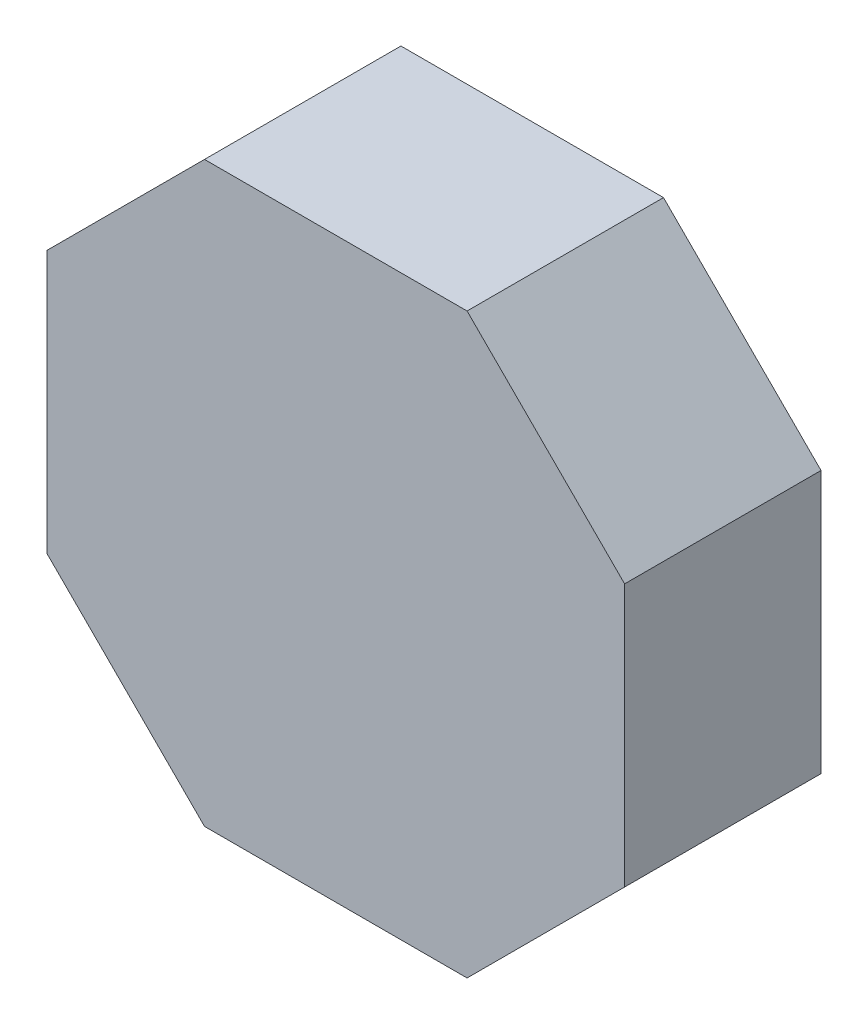
ISO-10303-21;
HEADER;
FILE_DESCRIPTION(('STEP AP214'),'2;1');
FILE_NAME('part.step','',(''),(''),'','','');
FILE_SCHEMA(('AUTOMOTIVE_DESIGN { 1 0 10303 214 1 1 1 1 }'));
ENDSEC;
DATA;
#1=APPLICATION_CONTEXT('core data for automotive mechanical design processes');
#2=APPLICATION_PROTOCOL_DEFINITION('international standard','automotive_design',2000,#1);
#3=PRODUCT_CONTEXT('',#1,'mechanical');
#4=PRODUCT('Part','Part','',(#3));
#5=PRODUCT_RELATED_PRODUCT_CATEGORY('part','',(#4));
#6=PRODUCT_DEFINITION_FORMATION('','',#4);
#7=PRODUCT_DEFINITION_CONTEXT('part definition',#1,'design');
#8=PRODUCT_DEFINITION('design','',#6,#7);
#9=PRODUCT_DEFINITION_SHAPE('','',#8);
#10=(LENGTH_UNIT() NAMED_UNIT(*) SI_UNIT(.MILLI.,.METRE.));
#11=(NAMED_UNIT(*) PLANE_ANGLE_UNIT() SI_UNIT($,.RADIAN.));
#12=(NAMED_UNIT(*) SI_UNIT($,.STERADIAN.) SOLID_ANGLE_UNIT());
#13=UNCERTAINTY_MEASURE_WITH_UNIT(LENGTH_MEASURE(1.E-05),#10,'distance_accuracy_value','');
#14=(GEOMETRIC_REPRESENTATION_CONTEXT(3) GLOBAL_UNCERTAINTY_ASSIGNED_CONTEXT((#13)) GLOBAL_UNIT_ASSIGNED_CONTEXT((#10,
#11,#12)) REPRESENTATION_CONTEXT('',''));
#15=CARTESIAN_POINT('',(0.,0.,0.));
#16=DIRECTION('',(0.,0.,1.));
#17=DIRECTION('',(1.,0.,0.));
#18=AXIS2_PLACEMENT_3D('',#15,#16,#17);
#19=CARTESIAN_POINT('',(-5.588,-2.54,3.80000002));
#20=DIRECTION('',(0.,0.,1.));
#21=DIRECTION('',(1.,0.,0.));
#22=AXIS2_PLACEMENT_3D('',#19,#20,#21);
#23=PLANE('',#22);
#24=DIRECTION('',(-0.707106781186548,-0.707106781186548,0.));
#25=VECTOR('',#24,1.);
#26=CARTESIAN_POINT('',(-5.588,2.54,3.80000002));
#27=LINE('',#26,#25);
#28=CARTESIAN_POINT('',(-5.588,2.54,3.80000002));
#29=VERTEX_POINT('',#28);
#30=CARTESIAN_POINT('',(-2.54,5.588,3.80000002));
#31=VERTEX_POINT('',#30);
#32=EDGE_CURVE('E117',#29,#31,#27,.F.);
#33=ORIENTED_EDGE('',*,*,#32,.F.);
#34=DIRECTION('',(0.,1.,0.));
#35=VECTOR('',#34,1.);
#36=CARTESIAN_POINT('',(-5.588,-2.54,3.80000002));
#37=LINE('',#36,#35);
#38=CARTESIAN_POINT('',(-5.588,-2.54,3.80000002));
#39=VERTEX_POINT('',#38);
#40=EDGE_CURVE('E94',#39,#29,#37,.T.);
#41=ORIENTED_EDGE('',*,*,#40,.F.);
#42=DIRECTION('',(0.707106781186548,-0.707106781186548,0.));
#43=VECTOR('',#42,1.);
#44=CARTESIAN_POINT('',(-2.54,-5.588,3.80000002));
#45=LINE('',#44,#43);
#46=CARTESIAN_POINT('',(-2.54,-5.588,3.80000002));
#47=VERTEX_POINT('',#46);
#48=EDGE_CURVE('E20',#47,#39,#45,.F.);
#49=ORIENTED_EDGE('',*,*,#48,.F.);
#50=DIRECTION('',(1.,0.,0.));
#51=VECTOR('',#50,1.);
#52=CARTESIAN_POINT('',(2.54,-5.588,3.80000002));
#53=LINE('',#52,#51);
#54=CARTESIAN_POINT('',(2.54,-5.588,3.80000002));
#55=VERTEX_POINT('',#54);
#56=EDGE_CURVE('E83',#55,#47,#53,.F.);
#57=ORIENTED_EDGE('',*,*,#56,.F.);
#58=DIRECTION('',(0.707106781186548,0.707106781186548,0.));
#59=VECTOR('',#58,1.);
#60=CARTESIAN_POINT('',(5.588,-2.54,3.80000002));
#61=LINE('',#60,#59);
#62=CARTESIAN_POINT('',(5.588,-2.54,3.80000002));
#63=VERTEX_POINT('',#62);
#64=EDGE_CURVE('E78',#63,#55,#61,.F.);
#65=ORIENTED_EDGE('',*,*,#64,.F.);
#66=DIRECTION('',(0.,1.,0.));
#67=VECTOR('',#66,1.);
#68=CARTESIAN_POINT('',(5.588,2.54,3.80000002));
#69=LINE('',#68,#67);
#70=CARTESIAN_POINT('',(5.588,2.54,3.80000002));
#71=VERTEX_POINT('',#70);
#72=EDGE_CURVE('E105',#71,#63,#69,.F.);
#73=ORIENTED_EDGE('',*,*,#72,.F.);
#74=DIRECTION('',(-0.707106781186548,0.707106781186548,0.));
#75=VECTOR('',#74,1.);
#76=CARTESIAN_POINT('',(2.54,5.588,3.80000002));
#77=LINE('',#76,#75);
#78=CARTESIAN_POINT('',(2.54,5.588,3.80000002));
#79=VERTEX_POINT('',#78);
#80=EDGE_CURVE('E109',#79,#71,#77,.F.);
#81=ORIENTED_EDGE('',*,*,#80,.F.);
#82=DIRECTION('',(1.,0.,0.));
#83=VECTOR('',#82,1.);
#84=CARTESIAN_POINT('',(-2.54,5.588,3.80000002));
#85=LINE('',#84,#83);
#86=EDGE_CURVE('E113',#31,#79,#85,.T.);
#87=ORIENTED_EDGE('',*,*,#86,.F.);
#88=EDGE_LOOP('',(#33,#41,#49,#57,#65,#73,#81,#87));
#89=FACE_BOUND('',#88,.T.);
#90=ADVANCED_FACE('F17',(#89),#23,.T.);
#91=CARTESIAN_POINT('',(-2.54,-5.588,0.));
#92=DIRECTION('',(-0.707106781186548,-0.707106781186548,0.));
#93=DIRECTION('',(0.707106781186548,-0.707106781186548,0.));
#94=AXIS2_PLACEMENT_3D('',#91,#92,#93);
#95=PLANE('',#94);
#96=DIRECTION('',(0.,0.,1.));
#97=VECTOR('',#96,1.);
#98=CARTESIAN_POINT('',(-5.588,-2.54,0.));
#99=LINE('',#98,#97);
#100=CARTESIAN_POINT('',(-5.588,-2.54,0.));
#101=VERTEX_POINT('',#100);
#102=EDGE_CURVE('E121',#101,#39,#99,.T.);
#103=ORIENTED_EDGE('',*,*,#102,.F.);
#104=DIRECTION('',(0.707106781186547,-0.707106781186547,0.));
#105=VECTOR('',#104,1.);
#106=CARTESIAN_POINT('',(-5.588,-2.54,0.));
#107=LINE('',#106,#105);
#108=CARTESIAN_POINT('',(-2.54,-5.588,0.));
#109=VERTEX_POINT('',#108);
#110=EDGE_CURVE('E100',#101,#109,#107,.T.);
#111=ORIENTED_EDGE('',*,*,#110,.T.);
#112=DIRECTION('',(0.,0.,-1.));
#113=VECTOR('',#112,1.);
#114=CARTESIAN_POINT('',(-2.54,-5.588,0.));
#115=LINE('',#114,#113);
#116=EDGE_CURVE('E88',#47,#109,#115,.T.);
#117=ORIENTED_EDGE('',*,*,#116,.F.);
#118=ORIENTED_EDGE('',*,*,#48,.T.);
#119=EDGE_LOOP('',(#103,#111,#117,#118));
#120=FACE_BOUND('',#119,.T.);
#121=ADVANCED_FACE('F99',(#120),#95,.T.);
#122=CARTESIAN_POINT('',(2.54,-5.588,0.));
#123=DIRECTION('',(0.,-1.,0.));
#124=DIRECTION('',(0.,0.,-1.));
#125=AXIS2_PLACEMENT_3D('',#122,#123,#124);
#126=PLANE('',#125);
#127=ORIENTED_EDGE('',*,*,#116,.T.);
#128=DIRECTION('',(1.,0.,0.));
#129=VECTOR('',#128,1.);
#130=CARTESIAN_POINT('',(-5.588,-5.588,0.));
#131=LINE('',#130,#129);
#132=CARTESIAN_POINT('',(2.54,-5.588,0.));
#133=VERTEX_POINT('',#132);
#134=EDGE_CURVE('E126',#109,#133,#131,.T.);
#135=ORIENTED_EDGE('',*,*,#134,.T.);
#136=DIRECTION('',(0.,0.,1.));
#137=VECTOR('',#136,1.);
#138=CARTESIAN_POINT('',(2.54,-5.588,0.));
#139=LINE('',#138,#137);
#140=EDGE_CURVE('E90',#55,#133,#139,.F.);
#141=ORIENTED_EDGE('',*,*,#140,.F.);
#142=ORIENTED_EDGE('',*,*,#56,.T.);
#143=EDGE_LOOP('',(#127,#135,#141,#142));
#144=FACE_BOUND('',#143,.T.);
#145=ADVANCED_FACE('F85',(#144),#126,.T.);
#146=CARTESIAN_POINT('',(5.588,-2.54,0.));
#147=DIRECTION('',(0.707106781186548,-0.707106781186548,0.));
#148=DIRECTION('',(0.707106781186548,0.707106781186548,0.));
#149=AXIS2_PLACEMENT_3D('',#146,#147,#148);
#150=PLANE('',#149);
#151=ORIENTED_EDGE('',*,*,#140,.T.);
#152=DIRECTION('',(0.707106781186548,0.707106781186547,0.));
#153=VECTOR('',#152,1.);
#154=CARTESIAN_POINT('',(2.54,-5.588,0.));
#155=LINE('',#154,#153);
#156=CARTESIAN_POINT('',(5.588,-2.54,0.));
#157=VERTEX_POINT('',#156);
#158=EDGE_CURVE('E128',#133,#157,#155,.T.);
#159=ORIENTED_EDGE('',*,*,#158,.T.);
#160=DIRECTION('',(0.,0.,-1.));
#161=VECTOR('',#160,1.);
#162=CARTESIAN_POINT('',(5.588,-2.54,0.));
#163=LINE('',#162,#161);
#164=EDGE_CURVE('E107',#63,#157,#163,.T.);
#165=ORIENTED_EDGE('',*,*,#164,.F.);
#166=ORIENTED_EDGE('',*,*,#64,.T.);
#167=EDGE_LOOP('',(#151,#159,#165,#166));
#168=FACE_BOUND('',#167,.T.);
#169=ADVANCED_FACE('F162',(#168),#150,.T.);
#170=CARTESIAN_POINT('',(5.588,2.54,0.));
#171=DIRECTION('',(1.,0.,0.));
#172=DIRECTION('',(0.,0.,-1.));
#173=AXIS2_PLACEMENT_3D('',#170,#171,#172);
#174=PLANE('',#173);
#175=ORIENTED_EDGE('',*,*,#164,.T.);
#176=DIRECTION('',(0.,1.,0.));
#177=VECTOR('',#176,1.);
#178=CARTESIAN_POINT('',(5.588,-2.54,0.));
#179=LINE('',#178,#177);
#180=CARTESIAN_POINT('',(5.588,2.54,0.));
#181=VERTEX_POINT('',#180);
#182=EDGE_CURVE('E131',#157,#181,#179,.T.);
#183=ORIENTED_EDGE('',*,*,#182,.T.);
#184=DIRECTION('',(0.,0.,1.));
#185=VECTOR('',#184,1.);
#186=CARTESIAN_POINT('',(5.588,2.54,0.));
#187=LINE('',#186,#185);
#188=EDGE_CURVE('E111',#71,#181,#187,.F.);
#189=ORIENTED_EDGE('',*,*,#188,.F.);
#190=ORIENTED_EDGE('',*,*,#72,.T.);
#191=EDGE_LOOP('',(#175,#183,#189,#190));
#192=FACE_BOUND('',#191,.T.);
#193=ADVANCED_FACE('F161',(#192),#174,.T.);
#194=CARTESIAN_POINT('',(2.54,5.588,0.));
#195=DIRECTION('',(0.707106781186548,0.707106781186548,0.));
#196=DIRECTION('',(-0.707106781186548,0.707106781186548,0.));
#197=AXIS2_PLACEMENT_3D('',#194,#195,#196);
#198=PLANE('',#197);
#199=ORIENTED_EDGE('',*,*,#188,.T.);
#200=DIRECTION('',(-0.707106781186548,0.707106781186547,0.));
#201=VECTOR('',#200,1.);
#202=CARTESIAN_POINT('',(5.588,2.54,0.));
#203=LINE('',#202,#201);
#204=CARTESIAN_POINT('',(2.54,5.588,0.));
#205=VERTEX_POINT('',#204);
#206=EDGE_CURVE('E134',#181,#205,#203,.T.);
#207=ORIENTED_EDGE('',*,*,#206,.T.);
#208=DIRECTION('',(0.,0.,1.));
#209=VECTOR('',#208,1.);
#210=CARTESIAN_POINT('',(2.54,5.588,0.));
#211=LINE('',#210,#209);
#212=EDGE_CURVE('E115',#79,#205,#211,.F.);
#213=ORIENTED_EDGE('',*,*,#212,.F.);
#214=ORIENTED_EDGE('',*,*,#80,.T.);
#215=EDGE_LOOP('',(#199,#207,#213,#214));
#216=FACE_BOUND('',#215,.T.);
#217=ADVANCED_FACE('F155',(#216),#198,.T.);
#218=CARTESIAN_POINT('',(-2.54,5.588,0.));
#219=DIRECTION('',(0.,1.,0.));
#220=DIRECTION('',(0.,0.,1.));
#221=AXIS2_PLACEMENT_3D('',#218,#219,#220);
#222=PLANE('',#221);
#223=ORIENTED_EDGE('',*,*,#212,.T.);
#224=DIRECTION('',(1.,0.,0.));
#225=VECTOR('',#224,1.);
#226=CARTESIAN_POINT('',(-5.588,5.588,0.));
#227=LINE('',#226,#225);
#228=CARTESIAN_POINT('',(-2.54,5.588,0.));
#229=VERTEX_POINT('',#228);
#230=EDGE_CURVE('E137',#205,#229,#227,.F.);
#231=ORIENTED_EDGE('',*,*,#230,.T.);
#232=DIRECTION('',(0.,0.,1.));
#233=VECTOR('',#232,1.);
#234=CARTESIAN_POINT('',(-2.54,5.588,0.));
#235=LINE('',#234,#233);
#236=EDGE_CURVE('E119',#31,#229,#235,.F.);
#237=ORIENTED_EDGE('',*,*,#236,.F.);
#238=ORIENTED_EDGE('',*,*,#86,.T.);
#239=EDGE_LOOP('',(#223,#231,#237,#238));
#240=FACE_BOUND('',#239,.T.);
#241=ADVANCED_FACE('F150',(#240),#222,.T.);
#242=CARTESIAN_POINT('',(-5.588,2.54,0.));
#243=DIRECTION('',(-0.707106781186548,0.707106781186548,0.));
#244=DIRECTION('',(-0.707106781186548,-0.707106781186548,0.));
#245=AXIS2_PLACEMENT_3D('',#242,#243,#244);
#246=PLANE('',#245);
#247=ORIENTED_EDGE('',*,*,#236,.T.);
#248=DIRECTION('',(-0.707106781186548,-0.707106781186547,0.));
#249=VECTOR('',#248,1.);
#250=CARTESIAN_POINT('',(-2.54,5.588,0.));
#251=LINE('',#250,#249);
#252=CARTESIAN_POINT('',(-5.588,2.54,0.));
#253=VERTEX_POINT('',#252);
#254=EDGE_CURVE('E26',#229,#253,#251,.T.);
#255=ORIENTED_EDGE('',*,*,#254,.T.);
#256=DIRECTION('',(0.,0.,1.));
#257=VECTOR('',#256,1.);
#258=CARTESIAN_POINT('',(-5.588,2.54,0.));
#259=LINE('',#258,#257);
#260=EDGE_CURVE('E34',#29,#253,#259,.F.);
#261=ORIENTED_EDGE('',*,*,#260,.F.);
#262=ORIENTED_EDGE('',*,*,#32,.T.);
#263=EDGE_LOOP('',(#247,#255,#261,#262));
#264=FACE_BOUND('',#263,.T.);
#265=ADVANCED_FACE('F143',(#264),#246,.T.);
#266=CARTESIAN_POINT('',(-5.588,-2.54,0.));
#267=DIRECTION('',(-1.,0.,0.));
#268=DIRECTION('',(0.,0.,1.));
#269=AXIS2_PLACEMENT_3D('',#266,#267,#268);
#270=PLANE('',#269);
#271=ORIENTED_EDGE('',*,*,#260,.T.);
#272=DIRECTION('',(0.,1.,0.));
#273=VECTOR('',#272,1.);
#274=CARTESIAN_POINT('',(-5.588,-2.54,0.));
#275=LINE('',#274,#273);
#276=EDGE_CURVE('E11',#253,#101,#275,.F.);
#277=ORIENTED_EDGE('',*,*,#276,.T.);
#278=ORIENTED_EDGE('',*,*,#102,.T.);
#279=ORIENTED_EDGE('',*,*,#40,.T.);
#280=EDGE_LOOP('',(#271,#277,#278,#279));
#281=FACE_BOUND('',#280,.T.);
#282=ADVANCED_FACE('F163',(#281),#270,.T.);
#283=CARTESIAN_POINT('',(-5.588,-2.54,0.));
#284=DIRECTION('',(0.,0.,1.));
#285=DIRECTION('',(1.,0.,0.));
#286=AXIS2_PLACEMENT_3D('',#283,#284,#285);
#287=PLANE('',#286);
#288=ORIENTED_EDGE('',*,*,#254,.F.);
#289=ORIENTED_EDGE('',*,*,#230,.F.);
#290=ORIENTED_EDGE('',*,*,#206,.F.);
#291=ORIENTED_EDGE('',*,*,#182,.F.);
#292=ORIENTED_EDGE('',*,*,#158,.F.);
#293=ORIENTED_EDGE('',*,*,#134,.F.);
#294=ORIENTED_EDGE('',*,*,#110,.F.);
#295=ORIENTED_EDGE('',*,*,#276,.F.);
#296=EDGE_LOOP('',(#288,#289,#290,#291,#292,#293,#294,#295));
#297=FACE_BOUND('',#296,.T.);
#298=ADVANCED_FACE('F147',(#297),#287,.F.);
#299=CLOSED_SHELL('',(#90,#121,#145,#169,#193,#217,#241,#265,#282,#298));
#300=MANIFOLD_SOLID_BREP('B1',#299);
#301=ADVANCED_BREP_SHAPE_REPRESENTATION('',(#18,#300),#14);
#302=SHAPE_DEFINITION_REPRESENTATION(#9,#301);
ENDSEC;
END-ISO-10303-21;
